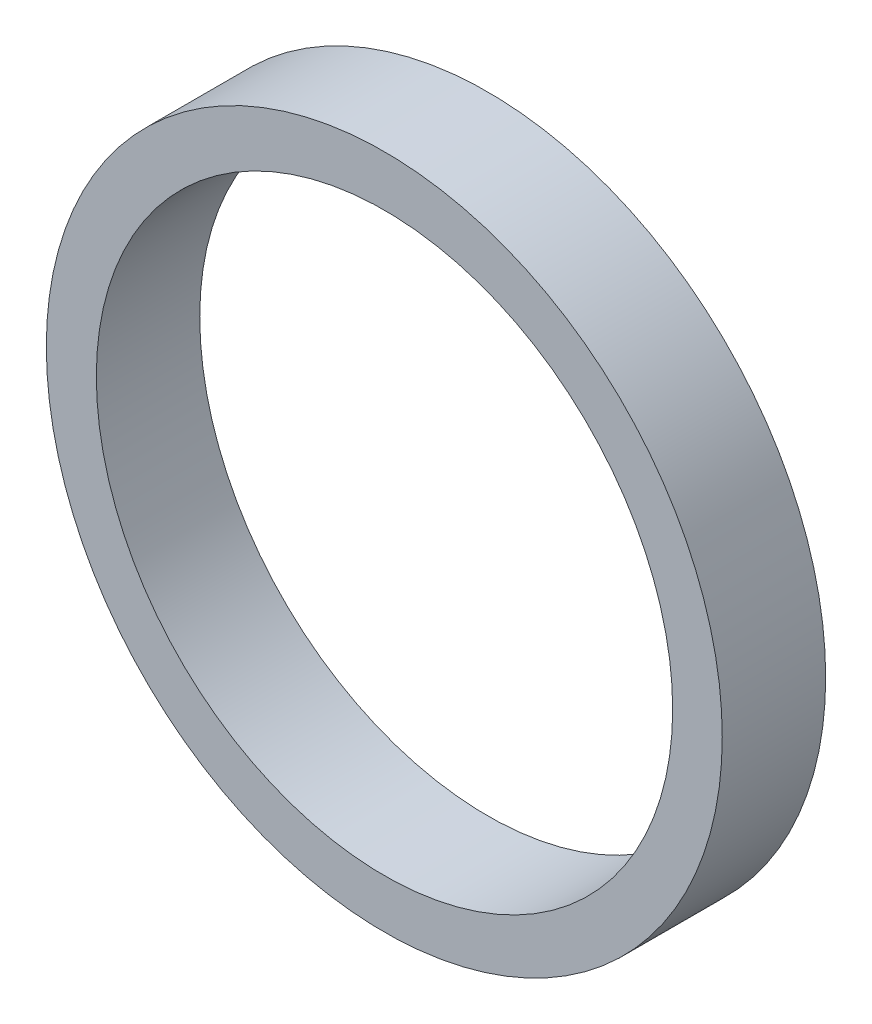
ISO-10303-21;
HEADER;
FILE_DESCRIPTION(('STEP AP214'),'2;1');
FILE_NAME('part.step','',(''),(''),'','','');
FILE_SCHEMA(('AUTOMOTIVE_DESIGN { 1 0 10303 214 1 1 1 1 }'));
ENDSEC;
DATA;
#1=APPLICATION_CONTEXT('core data for automotive mechanical design processes');
#2=APPLICATION_PROTOCOL_DEFINITION('international standard','automotive_design',2000,#1);
#3=PRODUCT_CONTEXT('',#1,'mechanical');
#4=PRODUCT('Part','Part','',(#3));
#5=PRODUCT_RELATED_PRODUCT_CATEGORY('part','',(#4));
#6=PRODUCT_DEFINITION_FORMATION('','',#4);
#7=PRODUCT_DEFINITION_CONTEXT('part definition',#1,'design');
#8=PRODUCT_DEFINITION('design','',#6,#7);
#9=PRODUCT_DEFINITION_SHAPE('','',#8);
#10=(LENGTH_UNIT() NAMED_UNIT(*) SI_UNIT(.MILLI.,.METRE.));
#11=(NAMED_UNIT(*) PLANE_ANGLE_UNIT() SI_UNIT($,.RADIAN.));
#12=(NAMED_UNIT(*) SI_UNIT($,.STERADIAN.) SOLID_ANGLE_UNIT());
#13=UNCERTAINTY_MEASURE_WITH_UNIT(LENGTH_MEASURE(1.E-05),#10,'distance_accuracy_value','');
#14=(GEOMETRIC_REPRESENTATION_CONTEXT(3) GLOBAL_UNCERTAINTY_ASSIGNED_CONTEXT((#13)) GLOBAL_UNIT_ASSIGNED_CONTEXT((#10,
#11,#12)) REPRESENTATION_CONTEXT('',''));
#15=CARTESIAN_POINT('',(0.,0.,0.));
#16=DIRECTION('',(0.,0.,1.));
#17=DIRECTION('',(1.,0.,0.));
#18=AXIS2_PLACEMENT_3D('',#15,#16,#17);
#19=CARTESIAN_POINT('',(40.0026069432497,15.989450737834,9.68));
#20=DIRECTION('',(0.,0.,-1.));
#21=DIRECTION('',(-1.,0.,0.));
#22=AXIS2_PLACEMENT_3D('',#19,#20,#21);
#23=CYLINDRICAL_SURFACE('',#22,3.5388399);
#24=CARTESIAN_POINT('',(40.0026069432497,15.989450737834,10.95));
#25=DIRECTION('',(0.,0.,-1.));
#26=DIRECTION('',(-1.,0.,0.));
#27=AXIS2_PLACEMENT_3D('',#24,#25,#26);
#28=CIRCLE('',#27,3.5388399);
#29=CARTESIAN_POINT('',(36.4637670432497,15.989450737834,10.95));
#30=VERTEX_POINT('',#29);
#31=EDGE_CURVE('E27',#30,#30,#28,.T.);
#32=ORIENTED_EDGE('',*,*,#31,.F.);
#33=EDGE_LOOP('',(#32));
#34=FACE_BOUND('',#33,.T.);
#35=CARTESIAN_POINT('',(40.0026069432497,15.989450737834,9.68));
#36=DIRECTION('',(0.,0.,-1.));
#37=DIRECTION('',(-1.,0.,0.));
#38=AXIS2_PLACEMENT_3D('',#35,#36,#37);
#39=CIRCLE('',#38,3.5388399);
#40=CARTESIAN_POINT('',(36.4637670432497,15.989450737834,9.68));
#41=VERTEX_POINT('',#40);
#42=EDGE_CURVE('E18',#41,#41,#39,.T.);
#43=ORIENTED_EDGE('',*,*,#42,.T.);
#44=EDGE_LOOP('',(#43));
#45=FACE_BOUND('',#44,.T.);
#46=ADVANCED_FACE('F15',(#34,#45),#23,.F.);
#47=CARTESIAN_POINT('',(27.99999999999,16.000000000005,9.68));
#48=DIRECTION('',(0.,0.,1.));
#49=DIRECTION('',(1.,0.,0.));
#50=AXIS2_PLACEMENT_3D('',#47,#48,#49);
#51=PLANE('',#50);
#52=CARTESIAN_POINT('',(40.,16.,9.68));
#53=DIRECTION('',(0.,0.,-1.));
#54=DIRECTION('',(-1.,0.,0.));
#55=AXIS2_PLACEMENT_3D('',#52,#53,#54);
#56=CIRCLE('',#55,4.1503195);
#57=CARTESIAN_POINT('',(35.8496805,16.,9.68));
#58=VERTEX_POINT('',#57);
#59=EDGE_CURVE('E22',#58,#58,#56,.F.);
#60=ORIENTED_EDGE('',*,*,#59,.F.);
#61=EDGE_LOOP('',(#60));
#62=FACE_BOUND('',#61,.T.);
#63=ORIENTED_EDGE('',*,*,#42,.F.);
#64=EDGE_LOOP('',(#63));
#65=FACE_BOUND('',#64,.T.);
#66=ADVANCED_FACE('F36',(#62,#65),#51,.F.);
#67=CARTESIAN_POINT('',(27.99999999999,16.000000000005,10.95));
#68=DIRECTION('',(0.,0.,1.));
#69=DIRECTION('',(1.,0.,0.));
#70=AXIS2_PLACEMENT_3D('',#67,#68,#69);
#71=PLANE('',#70);
#72=CARTESIAN_POINT('',(40.,16.,10.95));
#73=DIRECTION('',(0.,0.,-1.));
#74=DIRECTION('',(-1.,0.,0.));
#75=AXIS2_PLACEMENT_3D('',#72,#73,#74);
#76=CIRCLE('',#75,4.1503195);
#77=CARTESIAN_POINT('',(35.8496805,16.,10.95));
#78=VERTEX_POINT('',#77);
#79=EDGE_CURVE('E10',#78,#78,#76,.T.);
#80=ORIENTED_EDGE('',*,*,#79,.F.);
#81=EDGE_LOOP('',(#80));
#82=FACE_BOUND('',#81,.T.);
#83=ORIENTED_EDGE('',*,*,#31,.T.);
#84=EDGE_LOOP('',(#83));
#85=FACE_BOUND('',#84,.T.);
#86=ADVANCED_FACE('F38',(#82,#85),#71,.T.);
#87=CARTESIAN_POINT('',(40.,16.,9.68));
#88=DIRECTION('',(0.,0.,-1.));
#89=DIRECTION('',(-1.,0.,0.));
#90=AXIS2_PLACEMENT_3D('',#87,#88,#89);
#91=CYLINDRICAL_SURFACE('',#90,4.1503195);
#92=ORIENTED_EDGE('',*,*,#79,.T.);
#93=EDGE_LOOP('',(#92));
#94=FACE_BOUND('',#93,.T.);
#95=ORIENTED_EDGE('',*,*,#59,.T.);
#96=EDGE_LOOP('',(#95));
#97=FACE_BOUND('',#96,.T.);
#98=ADVANCED_FACE('F45',(#94,#97),#91,.T.);
#99=CLOSED_SHELL('',(#46,#66,#86,#98));
#100=MANIFOLD_SOLID_BREP('B1',#99);
#101=ADVANCED_BREP_SHAPE_REPRESENTATION('',(#18,#100),#14);
#102=SHAPE_DEFINITION_REPRESENTATION(#9,#101);
ENDSEC;
END-ISO-10303-21;
